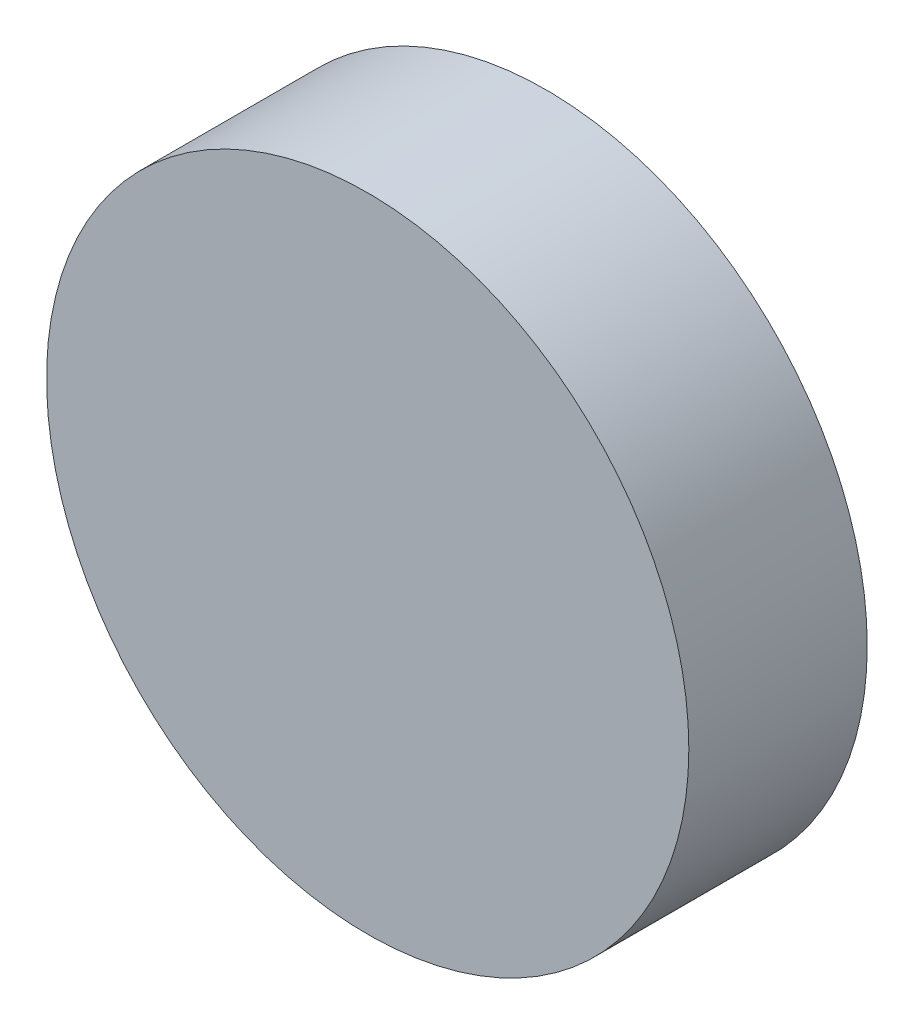
ISO-10303-21;
HEADER;
FILE_DESCRIPTION(('STEP AP214'),'2;1');
FILE_NAME('part.step','',(''),(''),'','','');
FILE_SCHEMA(('AUTOMOTIVE_DESIGN { 1 0 10303 214 1 1 1 1 }'));
ENDSEC;
DATA;
#1=APPLICATION_CONTEXT('core data for automotive mechanical design processes');
#2=APPLICATION_PROTOCOL_DEFINITION('international standard','automotive_design',2000,#1);
#3=PRODUCT_CONTEXT('',#1,'mechanical');
#4=PRODUCT('Part','Part','',(#3));
#5=PRODUCT_RELATED_PRODUCT_CATEGORY('part','',(#4));
#6=PRODUCT_DEFINITION_FORMATION('','',#4);
#7=PRODUCT_DEFINITION_CONTEXT('part definition',#1,'design');
#8=PRODUCT_DEFINITION('design','',#6,#7);
#9=PRODUCT_DEFINITION_SHAPE('','',#8);
#10=(LENGTH_UNIT() NAMED_UNIT(*) SI_UNIT(.MILLI.,.METRE.));
#11=(NAMED_UNIT(*) PLANE_ANGLE_UNIT() SI_UNIT($,.RADIAN.));
#12=(NAMED_UNIT(*) SI_UNIT($,.STERADIAN.) SOLID_ANGLE_UNIT());
#13=UNCERTAINTY_MEASURE_WITH_UNIT(LENGTH_MEASURE(1.E-05),#10,'distance_accuracy_value','');
#14=(GEOMETRIC_REPRESENTATION_CONTEXT(3) GLOBAL_UNCERTAINTY_ASSIGNED_CONTEXT((#13)) GLOBAL_UNIT_ASSIGNED_CONTEXT((#10,
#11,#12)) REPRESENTATION_CONTEXT('',''));
#15=CARTESIAN_POINT('',(0.,0.,0.));
#16=DIRECTION('',(0.,0.,1.));
#17=DIRECTION('',(1.,0.,0.));
#18=AXIS2_PLACEMENT_3D('',#15,#16,#17);
#19=CARTESIAN_POINT('',(0.,0.,127.));
#20=DIRECTION('',(0.,0.,-1.));
#21=DIRECTION('',(-1.,0.,0.));
#22=AXIS2_PLACEMENT_3D('',#19,#20,#21);
#23=CYLINDRICAL_SURFACE('',#22,228.6);
#24=CARTESIAN_POINT('',(0.,0.,127.));
#25=DIRECTION('',(0.,0.,1.));
#26=DIRECTION('',(1.,0.,0.));
#27=AXIS2_PLACEMENT_3D('',#24,#25,#26);
#28=CIRCLE('',#27,228.6);
#29=CARTESIAN_POINT('',(228.6,0.,127.));
#30=VERTEX_POINT('',#29);
#31=EDGE_CURVE('E10',#30,#30,#28,.T.);
#32=ORIENTED_EDGE('',*,*,#31,.F.);
#33=EDGE_LOOP('',(#32));
#34=FACE_BOUND('',#33,.T.);
#35=CARTESIAN_POINT('',(0.,0.,0.));
#36=DIRECTION('',(0.,0.,1.));
#37=DIRECTION('',(1.,0.,0.));
#38=AXIS2_PLACEMENT_3D('',#35,#36,#37);
#39=CIRCLE('',#38,228.6);
#40=CARTESIAN_POINT('',(228.6,0.,0.));
#41=VERTEX_POINT('',#40);
#42=EDGE_CURVE('E33',#41,#41,#39,.T.);
#43=ORIENTED_EDGE('',*,*,#42,.T.);
#44=EDGE_LOOP('',(#43));
#45=FACE_BOUND('',#44,.T.);
#46=ADVANCED_FACE('F30',(#34,#45),#23,.T.);
#47=CARTESIAN_POINT('',(0.,0.,127.));
#48=DIRECTION('',(0.,0.,1.));
#49=DIRECTION('',(1.,0.,0.));
#50=AXIS2_PLACEMENT_3D('',#47,#48,#49);
#51=PLANE('',#50);
#52=ORIENTED_EDGE('',*,*,#31,.T.);
#53=EDGE_LOOP('',(#52));
#54=FACE_BOUND('',#53,.T.);
#55=ADVANCED_FACE('F45',(#54),#51,.T.);
#56=CARTESIAN_POINT('',(0.,0.,0.));
#57=DIRECTION('',(0.,0.,1.));
#58=DIRECTION('',(1.,0.,0.));
#59=AXIS2_PLACEMENT_3D('',#56,#57,#58);
#60=PLANE('',#59);
#61=ORIENTED_EDGE('',*,*,#42,.F.);
#62=EDGE_LOOP('',(#61));
#63=FACE_BOUND('',#62,.T.);
#64=ADVANCED_FACE('F43',(#63),#60,.F.);
#65=CLOSED_SHELL('',(#46,#55,#64));
#66=MANIFOLD_SOLID_BREP('B2',#65);
#67=ADVANCED_BREP_SHAPE_REPRESENTATION('',(#18,#66),#14);
#68=SHAPE_DEFINITION_REPRESENTATION(#9,#67);
ENDSEC;
END-ISO-10303-21;
